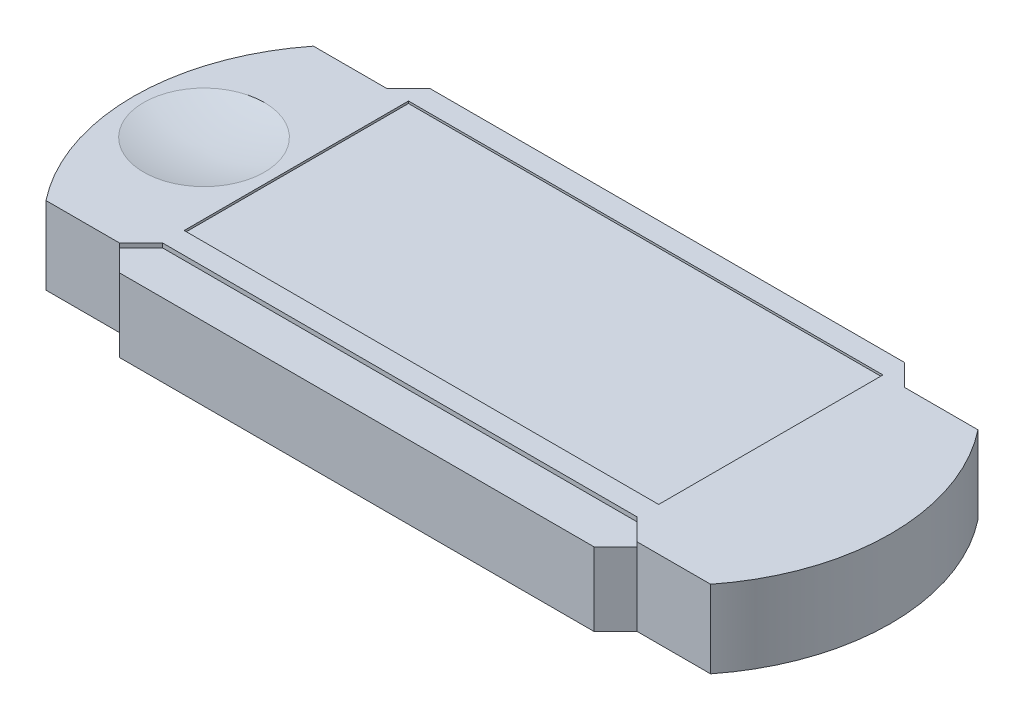
ISO-10303-21;
HEADER;
FILE_DESCRIPTION(('STEP AP214'),'2;1');
FILE_NAME('part.step','',(''),(''),'','','');
FILE_SCHEMA(('AUTOMOTIVE_DESIGN { 1 0 10303 214 1 1 1 1 }'));
ENDSEC;
DATA;
#1=APPLICATION_CONTEXT('core data for automotive mechanical design processes');
#2=APPLICATION_PROTOCOL_DEFINITION('international standard','automotive_design',2000,#1);
#3=PRODUCT_CONTEXT('',#1,'mechanical');
#4=PRODUCT('Part','Part','',(#3));
#5=PRODUCT_RELATED_PRODUCT_CATEGORY('part','',(#4));
#6=PRODUCT_DEFINITION_FORMATION('','',#4);
#7=PRODUCT_DEFINITION_CONTEXT('part definition',#1,'design');
#8=PRODUCT_DEFINITION('design','',#6,#7);
#9=PRODUCT_DEFINITION_SHAPE('','',#8);
#10=(LENGTH_UNIT() NAMED_UNIT(*) SI_UNIT(.MILLI.,.METRE.));
#11=(NAMED_UNIT(*) PLANE_ANGLE_UNIT() SI_UNIT($,.RADIAN.));
#12=(NAMED_UNIT(*) SI_UNIT($,.STERADIAN.) SOLID_ANGLE_UNIT());
#13=UNCERTAINTY_MEASURE_WITH_UNIT(LENGTH_MEASURE(1.E-05),#10,'distance_accuracy_value','');
#14=(GEOMETRIC_REPRESENTATION_CONTEXT(3) GLOBAL_UNCERTAINTY_ASSIGNED_CONTEXT((#13)) GLOBAL_UNIT_ASSIGNED_CONTEXT((#10,
#11,#12)) REPRESENTATION_CONTEXT('',''));
#15=CARTESIAN_POINT('',(0.,0.,0.));
#16=DIRECTION('',(0.,0.,1.));
#17=DIRECTION('',(1.,0.,0.));
#18=AXIS2_PLACEMENT_3D('',#15,#16,#17);
#19=CARTESIAN_POINT('',(55.,-18.,36.));
#20=DIRECTION('',(0.707106781186549,0.,0.707106781186546));
#21=DIRECTION('',(0.707106781186546,0.,-0.707106781186549));
#22=AXIS2_PLACEMENT_3D('',#19,#20,#21);
#23=PLANE('',#22);
#24=DIRECTION('',(0.,1.,0.));
#25=VECTOR('',#24,1.);
#26=CARTESIAN_POINT('',(60.,-18.,31.));
#27=LINE('',#26,#25);
#28=CARTESIAN_POINT('',(60.,-18.,31.));
#29=VERTEX_POINT('',#28);
#30=CARTESIAN_POINT('',(60.,-1.,31.));
#31=VERTEX_POINT('',#30);
#32=EDGE_CURVE('E43',#29,#31,#27,.T.);
#33=ORIENTED_EDGE('',*,*,#32,.T.);
#34=DIRECTION('',(0.707106781186546,0.,-0.707106781186549));
#35=VECTOR('',#34,1.);
#36=CARTESIAN_POINT('',(55.,-1.,36.));
#37=LINE('',#36,#35);
#38=CARTESIAN_POINT('',(55.,-1.,36.));
#39=VERTEX_POINT('',#38);
#40=EDGE_CURVE('E218',#39,#31,#37,.T.);
#41=ORIENTED_EDGE('',*,*,#40,.F.);
#42=DIRECTION('',(0.,1.,0.));
#43=VECTOR('',#42,1.);
#44=CARTESIAN_POINT('',(55.,-18.,36.));
#45=LINE('',#44,#43);
#46=CARTESIAN_POINT('',(55.,-18.,36.));
#47=VERTEX_POINT('',#46);
#48=EDGE_CURVE('E11',#47,#39,#45,.T.);
#49=ORIENTED_EDGE('',*,*,#48,.F.);
#50=DIRECTION('',(0.707106781186546,0.,-0.707106781186549));
#51=VECTOR('',#50,1.);
#52=CARTESIAN_POINT('',(55.,-18.,36.));
#53=LINE('',#52,#51);
#54=EDGE_CURVE('E197',#47,#29,#53,.T.);
#55=ORIENTED_EDGE('',*,*,#54,.T.);
#56=EDGE_LOOP('',(#33,#41,#49,#55));
#57=FACE_BOUND('',#56,.T.);
#58=ADVANCED_FACE('F40',(#57),#23,.T.);
#59=CARTESIAN_POINT('',(-55.,-18.,36.));
#60=DIRECTION('',(0.,0.,1.));
#61=DIRECTION('',(1.,0.,0.));
#62=AXIS2_PLACEMENT_3D('',#59,#60,#61);
#63=PLANE('',#62);
#64=ORIENTED_EDGE('',*,*,#48,.T.);
#65=DIRECTION('',(1.,0.,0.));
#66=VECTOR('',#65,1.);
#67=CARTESIAN_POINT('',(-55.,-1.,36.));
#68=LINE('',#67,#66);
#69=CARTESIAN_POINT('',(-55.,-1.,36.));
#70=VERTEX_POINT('',#69);
#71=EDGE_CURVE('E253',#70,#39,#68,.T.);
#72=ORIENTED_EDGE('',*,*,#71,.F.);
#73=DIRECTION('',(0.,1.,0.));
#74=VECTOR('',#73,1.);
#75=CARTESIAN_POINT('',(-55.,-18.,36.));
#76=LINE('',#75,#74);
#77=CARTESIAN_POINT('',(-55.,-18.,36.));
#78=VERTEX_POINT('',#77);
#79=EDGE_CURVE('E48',#78,#70,#76,.T.);
#80=ORIENTED_EDGE('',*,*,#79,.F.);
#81=DIRECTION('',(1.,0.,0.));
#82=VECTOR('',#81,1.);
#83=CARTESIAN_POINT('',(-55.,-18.,36.));
#84=LINE('',#83,#82);
#85=EDGE_CURVE('E160',#78,#47,#84,.T.);
#86=ORIENTED_EDGE('',*,*,#85,.T.);
#87=EDGE_LOOP('',(#64,#72,#80,#86));
#88=FACE_BOUND('',#87,.T.);
#89=ADVANCED_FACE('F353',(#88),#63,.T.);
#90=CARTESIAN_POINT('',(-55.,-18.,36.));
#91=DIRECTION('',(-0.707106781186549,0.,0.707106781186546));
#92=DIRECTION('',(0.707106781186546,0.,0.707106781186549));
#93=AXIS2_PLACEMENT_3D('',#90,#91,#92);
#94=PLANE('',#93);
#95=ORIENTED_EDGE('',*,*,#79,.T.);
#96=DIRECTION('',(0.707106781186546,0.,0.707106781186549));
#97=VECTOR('',#96,1.);
#98=CARTESIAN_POINT('',(-60.,-1.,31.));
#99=LINE('',#98,#97);
#100=CARTESIAN_POINT('',(-60.,-1.,31.));
#101=VERTEX_POINT('',#100);
#102=EDGE_CURVE('E149',#101,#70,#99,.T.);
#103=ORIENTED_EDGE('',*,*,#102,.F.);
#104=DIRECTION('',(0.,1.,0.));
#105=VECTOR('',#104,1.);
#106=CARTESIAN_POINT('',(-60.,-18.,31.));
#107=LINE('',#106,#105);
#108=CARTESIAN_POINT('',(-60.,-18.,31.));
#109=VERTEX_POINT('',#108);
#110=EDGE_CURVE('E141',#109,#101,#107,.T.);
#111=ORIENTED_EDGE('',*,*,#110,.F.);
#112=DIRECTION('',(0.707106781186546,0.,0.707106781186549));
#113=VECTOR('',#112,1.);
#114=CARTESIAN_POINT('',(-55.,-18.,36.));
#115=LINE('',#114,#113);
#116=EDGE_CURVE('E145',#109,#78,#115,.T.);
#117=ORIENTED_EDGE('',*,*,#116,.T.);
#118=EDGE_LOOP('',(#95,#103,#111,#117));
#119=FACE_BOUND('',#118,.T.);
#120=ADVANCED_FACE('F144',(#119),#94,.T.);
#121=CARTESIAN_POINT('',(-60.,-18.,31.));
#122=DIRECTION('',(0.,0.,1.));
#123=DIRECTION('',(1.,0.,0.));
#124=AXIS2_PLACEMENT_3D('',#121,#122,#123);
#125=PLANE('',#124);
#126=DIRECTION('',(1.,0.,0.));
#127=VECTOR('',#126,1.);
#128=CARTESIAN_POINT('',(-60.,0.,31.));
#129=LINE('',#128,#127);
#130=CARTESIAN_POINT('',(-77.0300904918661,0.,31.));
#131=VERTEX_POINT('',#130);
#132=CARTESIAN_POINT('',(-60.,0.,31.));
#133=VERTEX_POINT('',#132);
#134=EDGE_CURVE('E195',#131,#133,#129,.T.);
#135=ORIENTED_EDGE('',*,*,#134,.F.);
#136=DIRECTION('',(0.,1.,0.));
#137=VECTOR('',#136,1.);
#138=CARTESIAN_POINT('',(-77.0300904918661,-18.,31.));
#139=LINE('',#138,#137);
#140=CARTESIAN_POINT('',(-77.0300904918661,-18.,31.));
#141=VERTEX_POINT('',#140);
#142=EDGE_CURVE('E101',#141,#131,#139,.T.);
#143=ORIENTED_EDGE('',*,*,#142,.F.);
#144=DIRECTION('',(1.,0.,0.));
#145=VECTOR('',#144,1.);
#146=CARTESIAN_POINT('',(-60.,-18.,31.));
#147=LINE('',#146,#145);
#148=EDGE_CURVE('E158',#141,#109,#147,.T.);
#149=ORIENTED_EDGE('',*,*,#148,.T.);
#150=ORIENTED_EDGE('',*,*,#110,.T.);
#151=DIRECTION('',(0.,1.,0.));
#152=VECTOR('',#151,1.);
#153=CARTESIAN_POINT('',(-60.,-1.,31.));
#154=LINE('',#153,#152);
#155=EDGE_CURVE('E174',#101,#133,#154,.T.);
#156=ORIENTED_EDGE('',*,*,#155,.T.);
#157=EDGE_LOOP('',(#135,#143,#149,#150,#156));
#158=FACE_BOUND('',#157,.T.);
#159=ADVANCED_FACE('F162',(#158),#125,.T.);
#160=CARTESIAN_POINT('',(-37.8,-18.,0.));
#161=DIRECTION('',(0.,1.,0.));
#162=DIRECTION('',(0.,0.,1.));
#163=AXIS2_PLACEMENT_3D('',#160,#161,#162);
#164=CYLINDRICAL_SURFACE('',#163,50.);
#165=CARTESIAN_POINT('',(-37.8,0.,0.));
#166=DIRECTION('',(0.,1.,0.));
#167=DIRECTION('',(0.,0.,-1.));
#168=AXIS2_PLACEMENT_3D('',#165,#166,#167);
#169=CIRCLE('',#168,50.);
#170=CARTESIAN_POINT('',(-77.0300904918661,0.,-31.));
#171=VERTEX_POINT('',#170);
#172=EDGE_CURVE('E192',#171,#131,#169,.T.);
#173=ORIENTED_EDGE('',*,*,#172,.F.);
#174=DIRECTION('',(0.,1.,0.));
#175=VECTOR('',#174,1.);
#176=CARTESIAN_POINT('',(-77.0300904918661,-18.,-31.));
#177=LINE('',#176,#175);
#178=CARTESIAN_POINT('',(-77.0300904918661,-18.,-31.));
#179=VERTEX_POINT('',#178);
#180=EDGE_CURVE('E201',#179,#171,#177,.T.);
#181=ORIENTED_EDGE('',*,*,#180,.F.);
#182=CARTESIAN_POINT('',(-37.8,-18.,0.));
#183=DIRECTION('',(0.,1.,0.));
#184=DIRECTION('',(0.,0.,-1.));
#185=AXIS2_PLACEMENT_3D('',#182,#183,#184);
#186=CIRCLE('',#185,50.);
#187=EDGE_CURVE('E163',#179,#141,#186,.T.);
#188=ORIENTED_EDGE('',*,*,#187,.T.);
#189=ORIENTED_EDGE('',*,*,#142,.T.);
#190=EDGE_LOOP('',(#173,#181,#188,#189));
#191=FACE_BOUND('',#190,.T.);
#192=ADVANCED_FACE('F259',(#191),#164,.T.);
#193=CARTESIAN_POINT('',(-60.,-18.,-31.));
#194=DIRECTION('',(0.,0.,-1.));
#195=DIRECTION('',(-1.,0.,0.));
#196=AXIS2_PLACEMENT_3D('',#193,#194,#195);
#197=PLANE('',#196);
#198=DIRECTION('',(-1.,0.,0.));
#199=VECTOR('',#198,1.);
#200=CARTESIAN_POINT('',(-60.,0.,-31.));
#201=LINE('',#200,#199);
#202=CARTESIAN_POINT('',(-60.,0.,-31.));
#203=VERTEX_POINT('',#202);
#204=EDGE_CURVE('E189',#203,#171,#201,.T.);
#205=ORIENTED_EDGE('',*,*,#204,.F.);
#206=DIRECTION('',(0.,1.,0.));
#207=VECTOR('',#206,1.);
#208=CARTESIAN_POINT('',(-60.,-18.,-31.));
#209=LINE('',#208,#207);
#210=CARTESIAN_POINT('',(-60.,-18.,-31.));
#211=VERTEX_POINT('',#210);
#212=EDGE_CURVE('E203',#211,#203,#209,.T.);
#213=ORIENTED_EDGE('',*,*,#212,.F.);
#214=DIRECTION('',(-1.,0.,0.));
#215=VECTOR('',#214,1.);
#216=CARTESIAN_POINT('',(-60.,-18.,-31.));
#217=LINE('',#216,#215);
#218=EDGE_CURVE('E165',#211,#179,#217,.T.);
#219=ORIENTED_EDGE('',*,*,#218,.T.);
#220=ORIENTED_EDGE('',*,*,#180,.T.);
#221=EDGE_LOOP('',(#205,#213,#219,#220));
#222=FACE_BOUND('',#221,.T.);
#223=ADVANCED_FACE('F265',(#222),#197,.T.);
#224=CARTESIAN_POINT('',(-55.,-18.,-36.));
#225=DIRECTION('',(-0.707106781186549,0.,-0.707106781186546));
#226=DIRECTION('',(-0.707106781186546,0.,0.707106781186549));
#227=AXIS2_PLACEMENT_3D('',#224,#225,#226);
#228=PLANE('',#227);
#229=DIRECTION('',(-0.707106781186546,0.,0.707106781186549));
#230=VECTOR('',#229,1.);
#231=CARTESIAN_POINT('',(-55.,0.,-36.));
#232=LINE('',#231,#230);
#233=CARTESIAN_POINT('',(-55.,0.,-36.));
#234=VERTEX_POINT('',#233);
#235=EDGE_CURVE('E186',#234,#203,#232,.T.);
#236=ORIENTED_EDGE('',*,*,#235,.F.);
#237=DIRECTION('',(0.,1.,0.));
#238=VECTOR('',#237,1.);
#239=CARTESIAN_POINT('',(-55.,-18.,-36.));
#240=LINE('',#239,#238);
#241=CARTESIAN_POINT('',(-55.,-18.,-36.));
#242=VERTEX_POINT('',#241);
#243=EDGE_CURVE('E205',#242,#234,#240,.T.);
#244=ORIENTED_EDGE('',*,*,#243,.F.);
#245=DIRECTION('',(-0.707106781186546,0.,0.707106781186549));
#246=VECTOR('',#245,1.);
#247=CARTESIAN_POINT('',(-55.,-18.,-36.));
#248=LINE('',#247,#246);
#249=EDGE_CURVE('E266',#242,#211,#248,.T.);
#250=ORIENTED_EDGE('',*,*,#249,.T.);
#251=ORIENTED_EDGE('',*,*,#212,.T.);
#252=EDGE_LOOP('',(#236,#244,#250,#251));
#253=FACE_BOUND('',#252,.T.);
#254=ADVANCED_FACE('F372',(#253),#228,.T.);
#255=CARTESIAN_POINT('',(-55.,-18.,-36.));
#256=DIRECTION('',(0.,0.,-1.));
#257=DIRECTION('',(-1.,0.,0.));
#258=AXIS2_PLACEMENT_3D('',#255,#256,#257);
#259=PLANE('',#258);
#260=DIRECTION('',(-1.,0.,0.));
#261=VECTOR('',#260,1.);
#262=CARTESIAN_POINT('',(-55.,0.,-36.));
#263=LINE('',#262,#261);
#264=CARTESIAN_POINT('',(55.,0.,-36.));
#265=VERTEX_POINT('',#264);
#266=EDGE_CURVE('E183',#265,#234,#263,.T.);
#267=ORIENTED_EDGE('',*,*,#266,.F.);
#268=DIRECTION('',(0.,1.,0.));
#269=VECTOR('',#268,1.);
#270=CARTESIAN_POINT('',(55.,-18.,-36.));
#271=LINE('',#270,#269);
#272=CARTESIAN_POINT('',(55.,-18.,-36.));
#273=VERTEX_POINT('',#272);
#274=EDGE_CURVE('E207',#273,#265,#271,.T.);
#275=ORIENTED_EDGE('',*,*,#274,.F.);
#276=DIRECTION('',(-1.,0.,0.));
#277=VECTOR('',#276,1.);
#278=CARTESIAN_POINT('',(-55.,-18.,-36.));
#279=LINE('',#278,#277);
#280=EDGE_CURVE('E267',#273,#242,#279,.T.);
#281=ORIENTED_EDGE('',*,*,#280,.T.);
#282=ORIENTED_EDGE('',*,*,#243,.T.);
#283=EDGE_LOOP('',(#267,#275,#281,#282));
#284=FACE_BOUND('',#283,.T.);
#285=ADVANCED_FACE('F375',(#284),#259,.T.);
#286=CARTESIAN_POINT('',(55.,-18.,-36.));
#287=DIRECTION('',(0.707106781186549,0.,-0.707106781186546));
#288=DIRECTION('',(-0.707106781186546,0.,-0.707106781186549));
#289=AXIS2_PLACEMENT_3D('',#286,#287,#288);
#290=PLANE('',#289);
#291=DIRECTION('',(-0.707106781186546,0.,-0.707106781186549));
#292=VECTOR('',#291,1.);
#293=CARTESIAN_POINT('',(55.,0.,-36.));
#294=LINE('',#293,#292);
#295=CARTESIAN_POINT('',(60.,0.,-31.));
#296=VERTEX_POINT('',#295);
#297=EDGE_CURVE('E180',#296,#265,#294,.T.);
#298=ORIENTED_EDGE('',*,*,#297,.F.);
#299=DIRECTION('',(0.,1.,0.));
#300=VECTOR('',#299,1.);
#301=CARTESIAN_POINT('',(60.,-18.,-31.));
#302=LINE('',#301,#300);
#303=CARTESIAN_POINT('',(60.,-18.,-31.));
#304=VERTEX_POINT('',#303);
#305=EDGE_CURVE('E209',#304,#296,#302,.T.);
#306=ORIENTED_EDGE('',*,*,#305,.F.);
#307=DIRECTION('',(-0.707106781186546,0.,-0.707106781186549));
#308=VECTOR('',#307,1.);
#309=CARTESIAN_POINT('',(55.,-18.,-36.));
#310=LINE('',#309,#308);
#311=EDGE_CURVE('E272',#304,#273,#310,.T.);
#312=ORIENTED_EDGE('',*,*,#311,.T.);
#313=ORIENTED_EDGE('',*,*,#274,.T.);
#314=EDGE_LOOP('',(#298,#306,#312,#313));
#315=FACE_BOUND('',#314,.T.);
#316=ADVANCED_FACE('F379',(#315),#290,.T.);
#317=CARTESIAN_POINT('',(60.,-18.,-31.));
#318=DIRECTION('',(0.,0.,-1.));
#319=DIRECTION('',(-1.,0.,0.));
#320=AXIS2_PLACEMENT_3D('',#317,#318,#319);
#321=PLANE('',#320);
#322=DIRECTION('',(-1.,0.,0.));
#323=VECTOR('',#322,1.);
#324=CARTESIAN_POINT('',(60.,0.,-31.));
#325=LINE('',#324,#323);
#326=CARTESIAN_POINT('',(77.0300904918661,0.,-31.));
#327=VERTEX_POINT('',#326);
#328=EDGE_CURVE('E177',#327,#296,#325,.T.);
#329=ORIENTED_EDGE('',*,*,#328,.F.);
#330=DIRECTION('',(0.,1.,0.));
#331=VECTOR('',#330,1.);
#332=CARTESIAN_POINT('',(77.0300904918661,-18.,-31.));
#333=LINE('',#332,#331);
#334=CARTESIAN_POINT('',(77.0300904918661,-18.,-31.));
#335=VERTEX_POINT('',#334);
#336=EDGE_CURVE('E211',#335,#327,#333,.T.);
#337=ORIENTED_EDGE('',*,*,#336,.F.);
#338=DIRECTION('',(-1.,0.,0.));
#339=VECTOR('',#338,1.);
#340=CARTESIAN_POINT('',(60.,-18.,-31.));
#341=LINE('',#340,#339);
#342=EDGE_CURVE('E275',#335,#304,#341,.T.);
#343=ORIENTED_EDGE('',*,*,#342,.T.);
#344=ORIENTED_EDGE('',*,*,#305,.T.);
#345=EDGE_LOOP('',(#329,#337,#343,#344));
#346=FACE_BOUND('',#345,.T.);
#347=ADVANCED_FACE('F383',(#346),#321,.T.);
#348=CARTESIAN_POINT('',(37.8,-18.,0.));
#349=DIRECTION('',(0.,1.,0.));
#350=DIRECTION('',(0.,0.,1.));
#351=AXIS2_PLACEMENT_3D('',#348,#349,#350);
#352=CYLINDRICAL_SURFACE('',#351,50.);
#353=CARTESIAN_POINT('',(37.8,0.,0.));
#354=DIRECTION('',(0.,1.,0.));
#355=DIRECTION('',(0.,0.,1.));
#356=AXIS2_PLACEMENT_3D('',#353,#354,#355);
#357=CIRCLE('',#356,50.);
#358=CARTESIAN_POINT('',(77.0300904918661,0.,31.));
#359=VERTEX_POINT('',#358);
#360=EDGE_CURVE('E173',#359,#327,#357,.T.);
#361=ORIENTED_EDGE('',*,*,#360,.F.);
#362=DIRECTION('',(0.,1.,0.));
#363=VECTOR('',#362,1.);
#364=CARTESIAN_POINT('',(77.0300904918661,-18.,31.));
#365=LINE('',#364,#363);
#366=CARTESIAN_POINT('',(77.0300904918661,-18.,31.));
#367=VERTEX_POINT('',#366);
#368=EDGE_CURVE('E212',#367,#359,#365,.T.);
#369=ORIENTED_EDGE('',*,*,#368,.F.);
#370=CARTESIAN_POINT('',(37.8,-18.,0.));
#371=DIRECTION('',(0.,1.,0.));
#372=DIRECTION('',(0.,0.,1.));
#373=AXIS2_PLACEMENT_3D('',#370,#371,#372);
#374=CIRCLE('',#373,50.);
#375=EDGE_CURVE('E278',#367,#335,#374,.T.);
#376=ORIENTED_EDGE('',*,*,#375,.T.);
#377=ORIENTED_EDGE('',*,*,#336,.T.);
#378=EDGE_LOOP('',(#361,#369,#376,#377));
#379=FACE_BOUND('',#378,.T.);
#380=ADVANCED_FACE('F387',(#379),#352,.T.);
#381=CARTESIAN_POINT('',(60.,-18.,31.));
#382=DIRECTION('',(0.,0.,1.));
#383=DIRECTION('',(1.,0.,0.));
#384=AXIS2_PLACEMENT_3D('',#381,#382,#383);
#385=PLANE('',#384);
#386=DIRECTION('',(1.,0.,0.));
#387=VECTOR('',#386,1.);
#388=CARTESIAN_POINT('',(60.,0.,31.));
#389=LINE('',#388,#387);
#390=CARTESIAN_POINT('',(60.,0.,31.));
#391=VERTEX_POINT('',#390);
#392=EDGE_CURVE('E170',#391,#359,#389,.T.);
#393=ORIENTED_EDGE('',*,*,#392,.F.);
#394=DIRECTION('',(0.,1.,0.));
#395=VECTOR('',#394,1.);
#396=CARTESIAN_POINT('',(60.,-1.,31.));
#397=LINE('',#396,#395);
#398=EDGE_CURVE('E284',#31,#391,#397,.T.);
#399=ORIENTED_EDGE('',*,*,#398,.F.);
#400=ORIENTED_EDGE('',*,*,#32,.F.);
#401=DIRECTION('',(1.,0.,0.));
#402=VECTOR('',#401,1.);
#403=CARTESIAN_POINT('',(60.,-18.,31.));
#404=LINE('',#403,#402);
#405=EDGE_CURVE('E281',#29,#367,#404,.T.);
#406=ORIENTED_EDGE('',*,*,#405,.T.);
#407=ORIENTED_EDGE('',*,*,#368,.T.);
#408=EDGE_LOOP('',(#393,#399,#400,#406,#407));
#409=FACE_BOUND('',#408,.T.);
#410=ADVANCED_FACE('F390',(#409),#385,.T.);
#411=CARTESIAN_POINT('',(37.8,-18.,0.));
#412=DIRECTION('',(0.,1.,0.));
#413=DIRECTION('',(0.,0.,1.));
#414=AXIS2_PLACEMENT_3D('',#411,#412,#413);
#415=PLANE('',#414);
#416=ORIENTED_EDGE('',*,*,#54,.F.);
#417=ORIENTED_EDGE('',*,*,#85,.F.);
#418=ORIENTED_EDGE('',*,*,#116,.F.);
#419=ORIENTED_EDGE('',*,*,#148,.F.);
#420=ORIENTED_EDGE('',*,*,#187,.F.);
#421=ORIENTED_EDGE('',*,*,#218,.F.);
#422=ORIENTED_EDGE('',*,*,#249,.F.);
#423=ORIENTED_EDGE('',*,*,#280,.F.);
#424=ORIENTED_EDGE('',*,*,#311,.F.);
#425=ORIENTED_EDGE('',*,*,#342,.F.);
#426=ORIENTED_EDGE('',*,*,#375,.F.);
#427=ORIENTED_EDGE('',*,*,#405,.F.);
#428=EDGE_LOOP('',(#416,#417,#418,#419,#420,#421,#422,#423,#424,#425,#426,#427));
#429=FACE_BOUND('',#428,.T.);
#430=ADVANCED_FACE('F156',(#429),#415,.F.);
#431=CARTESIAN_POINT('',(37.8,0.,0.));
#432=DIRECTION('',(0.,1.,0.));
#433=DIRECTION('',(0.,0.,1.));
#434=AXIS2_PLACEMENT_3D('',#431,#432,#433);
#435=PLANE('',#434);
#436=CARTESIAN_POINT('',(-71.4,0.,0.));
#437=DIRECTION('',(0.,-1.,0.));
#438=DIRECTION('',(0.,0.,-1.));
#439=AXIS2_PLACEMENT_3D('',#436,#437,#438);
#440=CIRCLE('',#439,14.);
#441=CARTESIAN_POINT('',(-71.4,0.,-14.));
#442=VERTEX_POINT('',#441);
#443=EDGE_CURVE('E324',#442,#442,#440,.T.);
#444=ORIENTED_EDGE('',*,*,#443,.T.);
#445=EDGE_LOOP('',(#444));
#446=FACE_BOUND('',#445,.T.);
#447=DIRECTION('',(0.,0.,-1.));
#448=VECTOR('',#447,1.);
#449=CARTESIAN_POINT('',(55.,0.,-31.));
#450=LINE('',#449,#448);
#451=CARTESIAN_POINT('',(55.,0.,21.));
#452=VERTEX_POINT('',#451);
#453=CARTESIAN_POINT('',(55.,0.,-31.));
#454=VERTEX_POINT('',#453);
#455=EDGE_CURVE('E56',#452,#454,#450,.T.);
#456=ORIENTED_EDGE('',*,*,#455,.F.);
#457=DIRECTION('',(1.,0.,0.));
#458=VECTOR('',#457,1.);
#459=CARTESIAN_POINT('',(-55.,0.,21.));
#460=LINE('',#459,#458);
#461=CARTESIAN_POINT('',(-55.,0.,21.));
#462=VERTEX_POINT('',#461);
#463=EDGE_CURVE('E313',#462,#452,#460,.T.);
#464=ORIENTED_EDGE('',*,*,#463,.F.);
#465=DIRECTION('',(0.,0.,1.));
#466=VECTOR('',#465,1.);
#467=CARTESIAN_POINT('',(-55.,0.,-31.));
#468=LINE('',#467,#466);
#469=CARTESIAN_POINT('',(-55.,0.,-31.));
#470=VERTEX_POINT('',#469);
#471=EDGE_CURVE('E317',#470,#462,#468,.T.);
#472=ORIENTED_EDGE('',*,*,#471,.F.);
#473=DIRECTION('',(-1.,0.,0.));
#474=VECTOR('',#473,1.);
#475=CARTESIAN_POINT('',(-55.,0.,-31.));
#476=LINE('',#475,#474);
#477=EDGE_CURVE('E320',#454,#470,#476,.T.);
#478=ORIENTED_EDGE('',*,*,#477,.F.);
#479=EDGE_LOOP('',(#456,#464,#472,#478));
#480=FACE_BOUND('',#479,.T.);
#481=DIRECTION('',(-0.707106781186546,0.,0.707106781186549));
#482=VECTOR('',#481,1.);
#483=CARTESIAN_POINT('',(-60.,0.,31.));
#484=LINE('',#483,#482);
#485=CARTESIAN_POINT('',(-55.,0.,26.));
#486=VERTEX_POINT('',#485);
#487=EDGE_CURVE('E248',#486,#133,#484,.T.);
#488=ORIENTED_EDGE('',*,*,#487,.F.);
#489=DIRECTION('',(-1.,0.,0.));
#490=VECTOR('',#489,1.);
#491=CARTESIAN_POINT('',(-55.,0.,26.));
#492=LINE('',#491,#490);
#493=CARTESIAN_POINT('',(55.,0.,26.));
#494=VERTEX_POINT('',#493);
#495=EDGE_CURVE('E254',#494,#486,#492,.T.);
#496=ORIENTED_EDGE('',*,*,#495,.F.);
#497=DIRECTION('',(-0.707106781186546,0.,-0.707106781186549));
#498=VECTOR('',#497,1.);
#499=CARTESIAN_POINT('',(55.,0.,26.));
#500=LINE('',#499,#498);
#501=EDGE_CURVE('E290',#391,#494,#500,.T.);
#502=ORIENTED_EDGE('',*,*,#501,.F.);
#503=ORIENTED_EDGE('',*,*,#392,.T.);
#504=ORIENTED_EDGE('',*,*,#360,.T.);
#505=ORIENTED_EDGE('',*,*,#328,.T.);
#506=ORIENTED_EDGE('',*,*,#297,.T.);
#507=ORIENTED_EDGE('',*,*,#266,.T.);
#508=ORIENTED_EDGE('',*,*,#235,.T.);
#509=ORIENTED_EDGE('',*,*,#204,.T.);
#510=ORIENTED_EDGE('',*,*,#172,.T.);
#511=ORIENTED_EDGE('',*,*,#134,.T.);
#512=EDGE_LOOP('',(#488,#496,#502,#503,#504,#505,#506,#507,#508,#509,#510,#511));
#513=FACE_BOUND('',#512,.T.);
#514=ADVANCED_FACE('F257',(#446,#480,#513),#435,.T.);
#515=CARTESIAN_POINT('',(-60.,-1.,31.));
#516=DIRECTION('',(-0.707106781186549,0.,-0.707106781186546));
#517=DIRECTION('',(-0.707106781186546,0.,0.707106781186549));
#518=AXIS2_PLACEMENT_3D('',#515,#516,#517);
#519=PLANE('',#518);
#520=ORIENTED_EDGE('',*,*,#487,.T.);
#521=ORIENTED_EDGE('',*,*,#155,.F.);
#522=DIRECTION('',(-0.707106781186546,0.,0.707106781186549));
#523=VECTOR('',#522,1.);
#524=CARTESIAN_POINT('',(-60.,-1.,31.));
#525=LINE('',#524,#523);
#526=CARTESIAN_POINT('',(-55.,-1.,26.));
#527=VERTEX_POINT('',#526);
#528=EDGE_CURVE('E295',#527,#101,#525,.T.);
#529=ORIENTED_EDGE('',*,*,#528,.F.);
#530=DIRECTION('',(0.,1.,0.));
#531=VECTOR('',#530,1.);
#532=CARTESIAN_POINT('',(-55.,-1.,26.));
#533=LINE('',#532,#531);
#534=EDGE_CURVE('E245',#527,#486,#533,.T.);
#535=ORIENTED_EDGE('',*,*,#534,.T.);
#536=EDGE_LOOP('',(#520,#521,#529,#535));
#537=FACE_BOUND('',#536,.T.);
#538=ADVANCED_FACE('F249',(#537),#519,.F.);
#539=CARTESIAN_POINT('',(-55.,-1.,26.));
#540=DIRECTION('',(0.,0.,-1.));
#541=DIRECTION('',(-1.,0.,0.));
#542=AXIS2_PLACEMENT_3D('',#539,#540,#541);
#543=PLANE('',#542);
#544=ORIENTED_EDGE('',*,*,#495,.T.);
#545=ORIENTED_EDGE('',*,*,#534,.F.);
#546=DIRECTION('',(-1.,0.,0.));
#547=VECTOR('',#546,1.);
#548=CARTESIAN_POINT('',(-55.,-1.,26.));
#549=LINE('',#548,#547);
#550=CARTESIAN_POINT('',(55.,-1.,26.));
#551=VERTEX_POINT('',#550);
#552=EDGE_CURVE('E297',#551,#527,#549,.T.);
#553=ORIENTED_EDGE('',*,*,#552,.F.);
#554=DIRECTION('',(0.,1.,0.));
#555=VECTOR('',#554,1.);
#556=CARTESIAN_POINT('',(55.,-1.,26.));
#557=LINE('',#556,#555);
#558=EDGE_CURVE('E286',#551,#494,#557,.T.);
#559=ORIENTED_EDGE('',*,*,#558,.T.);
#560=EDGE_LOOP('',(#544,#545,#553,#559));
#561=FACE_BOUND('',#560,.T.);
#562=ADVANCED_FACE('F400',(#561),#543,.F.);
#563=CARTESIAN_POINT('',(55.,-1.,26.));
#564=DIRECTION('',(0.707106781186549,0.,-0.707106781186546));
#565=DIRECTION('',(-0.707106781186546,0.,-0.707106781186549));
#566=AXIS2_PLACEMENT_3D('',#563,#564,#565);
#567=PLANE('',#566);
#568=ORIENTED_EDGE('',*,*,#501,.T.);
#569=ORIENTED_EDGE('',*,*,#558,.F.);
#570=DIRECTION('',(-0.707106781186546,0.,-0.707106781186549));
#571=VECTOR('',#570,1.);
#572=CARTESIAN_POINT('',(55.,-1.,26.));
#573=LINE('',#572,#571);
#574=EDGE_CURVE('E225',#31,#551,#573,.T.);
#575=ORIENTED_EDGE('',*,*,#574,.F.);
#576=ORIENTED_EDGE('',*,*,#398,.T.);
#577=EDGE_LOOP('',(#568,#569,#575,#576));
#578=FACE_BOUND('',#577,.T.);
#579=ADVANCED_FACE('F397',(#578),#567,.F.);
#580=CARTESIAN_POINT('',(0.,-1.,0.));
#581=DIRECTION('',(0.,1.,0.));
#582=DIRECTION('',(0.,0.,1.));
#583=AXIS2_PLACEMENT_3D('',#580,#581,#582);
#584=PLANE('',#583);
#585=ORIENTED_EDGE('',*,*,#71,.T.);
#586=ORIENTED_EDGE('',*,*,#40,.T.);
#587=ORIENTED_EDGE('',*,*,#574,.T.);
#588=ORIENTED_EDGE('',*,*,#552,.T.);
#589=ORIENTED_EDGE('',*,*,#528,.T.);
#590=ORIENTED_EDGE('',*,*,#102,.T.);
#591=EDGE_LOOP('',(#585,#586,#587,#588,#589,#590));
#592=FACE_BOUND('',#591,.T.);
#593=ADVANCED_FACE('F402',(#592),#584,.T.);
#594=CARTESIAN_POINT('',(55.,-0.5,-31.));
#595=DIRECTION('',(1.,0.,0.));
#596=DIRECTION('',(0.,0.,-1.));
#597=AXIS2_PLACEMENT_3D('',#594,#595,#596);
#598=PLANE('',#597);
#599=ORIENTED_EDGE('',*,*,#455,.T.);
#600=DIRECTION('',(0.,1.,0.));
#601=VECTOR('',#600,1.);
#602=CARTESIAN_POINT('',(55.,-0.5,-31.));
#603=LINE('',#602,#601);
#604=CARTESIAN_POINT('',(55.,-0.5,-31.));
#605=VERTEX_POINT('',#604);
#606=EDGE_CURVE('E303',#605,#454,#603,.T.);
#607=ORIENTED_EDGE('',*,*,#606,.F.);
#608=DIRECTION('',(0.,0.,-1.));
#609=VECTOR('',#608,1.);
#610=CARTESIAN_POINT('',(55.,-0.5,-31.));
#611=LINE('',#610,#609);
#612=CARTESIAN_POINT('',(55.,-0.5,21.));
#613=VERTEX_POINT('',#612);
#614=EDGE_CURVE('E316',#613,#605,#611,.T.);
#615=ORIENTED_EDGE('',*,*,#614,.F.);
#616=DIRECTION('',(0.,1.,0.));
#617=VECTOR('',#616,1.);
#618=CARTESIAN_POINT('',(55.,-0.5,21.));
#619=LINE('',#618,#617);
#620=EDGE_CURVE('E293',#613,#452,#619,.T.);
#621=ORIENTED_EDGE('',*,*,#620,.T.);
#622=EDGE_LOOP('',(#599,#607,#615,#621));
#623=FACE_BOUND('',#622,.T.);
#624=ADVANCED_FACE('F405',(#623),#598,.F.);
#625=CARTESIAN_POINT('',(-55.,-0.5,21.));
#626=DIRECTION('',(0.,0.,1.));
#627=DIRECTION('',(1.,0.,0.));
#628=AXIS2_PLACEMENT_3D('',#625,#626,#627);
#629=PLANE('',#628);
#630=ORIENTED_EDGE('',*,*,#463,.T.);
#631=ORIENTED_EDGE('',*,*,#620,.F.);
#632=DIRECTION('',(1.,0.,0.));
#633=VECTOR('',#632,1.);
#634=CARTESIAN_POINT('',(-55.,-0.5,21.));
#635=LINE('',#634,#633);
#636=CARTESIAN_POINT('',(-55.,-0.5,21.));
#637=VERTEX_POINT('',#636);
#638=EDGE_CURVE('E306',#637,#613,#635,.T.);
#639=ORIENTED_EDGE('',*,*,#638,.F.);
#640=DIRECTION('',(0.,1.,0.));
#641=VECTOR('',#640,1.);
#642=CARTESIAN_POINT('',(-55.,-0.5,21.));
#643=LINE('',#642,#641);
#644=EDGE_CURVE('E309',#637,#462,#643,.T.);
#645=ORIENTED_EDGE('',*,*,#644,.T.);
#646=EDGE_LOOP('',(#630,#631,#639,#645));
#647=FACE_BOUND('',#646,.T.);
#648=ADVANCED_FACE('F411',(#647),#629,.F.);
#649=CARTESIAN_POINT('',(-55.,-0.5,-31.));
#650=DIRECTION('',(-1.,0.,0.));
#651=DIRECTION('',(0.,0.,1.));
#652=AXIS2_PLACEMENT_3D('',#649,#650,#651);
#653=PLANE('',#652);
#654=ORIENTED_EDGE('',*,*,#471,.T.);
#655=ORIENTED_EDGE('',*,*,#644,.F.);
#656=DIRECTION('',(0.,0.,1.));
#657=VECTOR('',#656,1.);
#658=CARTESIAN_POINT('',(-55.,-0.5,-31.));
#659=LINE('',#658,#657);
#660=CARTESIAN_POINT('',(-55.,-0.5,-31.));
#661=VERTEX_POINT('',#660);
#662=EDGE_CURVE('E327',#661,#637,#659,.T.);
#663=ORIENTED_EDGE('',*,*,#662,.F.);
#664=DIRECTION('',(0.,1.,0.));
#665=VECTOR('',#664,1.);
#666=CARTESIAN_POINT('',(-55.,-0.5,-31.));
#667=LINE('',#666,#665);
#668=EDGE_CURVE('E305',#661,#470,#667,.T.);
#669=ORIENTED_EDGE('',*,*,#668,.T.);
#670=EDGE_LOOP('',(#654,#655,#663,#669));
#671=FACE_BOUND('',#670,.T.);
#672=ADVANCED_FACE('F447',(#671),#653,.F.);
#673=CARTESIAN_POINT('',(-55.,-0.5,-31.));
#674=DIRECTION('',(0.,0.,-1.));
#675=DIRECTION('',(-1.,0.,0.));
#676=AXIS2_PLACEMENT_3D('',#673,#674,#675);
#677=PLANE('',#676);
#678=ORIENTED_EDGE('',*,*,#477,.T.);
#679=ORIENTED_EDGE('',*,*,#668,.F.);
#680=DIRECTION('',(-1.,0.,0.));
#681=VECTOR('',#680,1.);
#682=CARTESIAN_POINT('',(-55.,-0.5,-31.));
#683=LINE('',#682,#681);
#684=EDGE_CURVE('E330',#605,#661,#683,.T.);
#685=ORIENTED_EDGE('',*,*,#684,.F.);
#686=ORIENTED_EDGE('',*,*,#606,.T.);
#687=EDGE_LOOP('',(#678,#679,#685,#686));
#688=FACE_BOUND('',#687,.T.);
#689=ADVANCED_FACE('F348',(#688),#677,.F.);
#690=CARTESIAN_POINT('',(0.,-0.5,0.));
#691=DIRECTION('',(0.,1.,0.));
#692=DIRECTION('',(0.,0.,1.));
#693=AXIS2_PLACEMENT_3D('',#690,#691,#692);
#694=PLANE('',#693);
#695=ORIENTED_EDGE('',*,*,#614,.T.);
#696=ORIENTED_EDGE('',*,*,#684,.T.);
#697=ORIENTED_EDGE('',*,*,#662,.T.);
#698=ORIENTED_EDGE('',*,*,#638,.T.);
#699=EDGE_LOOP('',(#695,#696,#697,#698));
#700=FACE_BOUND('',#699,.T.);
#701=ADVANCED_FACE('F342',(#700),#694,.T.);
#702=CARTESIAN_POINT('',(-71.4,52.9953701718953,0.713624310270763));
#703=DIRECTION('',(-1.,0.,0.));
#704=DIRECTION('',(0.,0.,-1.));
#705=AXIS2_PLACEMENT_3D('',#702,#703,#704);
#706=CIRCLE('',#705,55.);
#707=TRIMMED_CURVE('',#706,(PARAMETER_VALUE(-1.55782097525067)),
(PARAMETER_VALUE(1.55782097525067)),.T.,.PARAMETER.);
#708=CARTESIAN_POINT('',(-71.4,52.9953701718953,0.));
#709=DIRECTION('',(0.,-1.,0.));
#710=AXIS1_PLACEMENT('',#708,#709);
#711=SURFACE_OF_REVOLUTION('',#707,#710);
#712=CARTESIAN_POINT('',(-71.4,-2.,0.));
#713=VERTEX_POINT('',#712);
#714=VERTEX_LOOP('',#713);
#715=FACE_BOUND('',#714,.T.);
#716=ORIENTED_EDGE('',*,*,#443,.F.);
#717=EDGE_LOOP('',(#716));
#718=FACE_BOUND('',#717,.T.);
#719=ADVANCED_FACE('F340',(#715,#718),#711,.F.);
#720=CLOSED_SHELL('',(#58,#89,#120,#159,#192,#223,#254,#285,#316,#347,#380,#410,#430,#514,#538,
#562,#579,#593,#624,#648,#672,#689,#701,#719));
#721=MANIFOLD_SOLID_BREP('B2',#720);
#722=ADVANCED_BREP_SHAPE_REPRESENTATION('',(#18,#721),#14);
#723=SHAPE_DEFINITION_REPRESENTATION(#9,#722);
ENDSEC;
END-ISO-10303-21;
